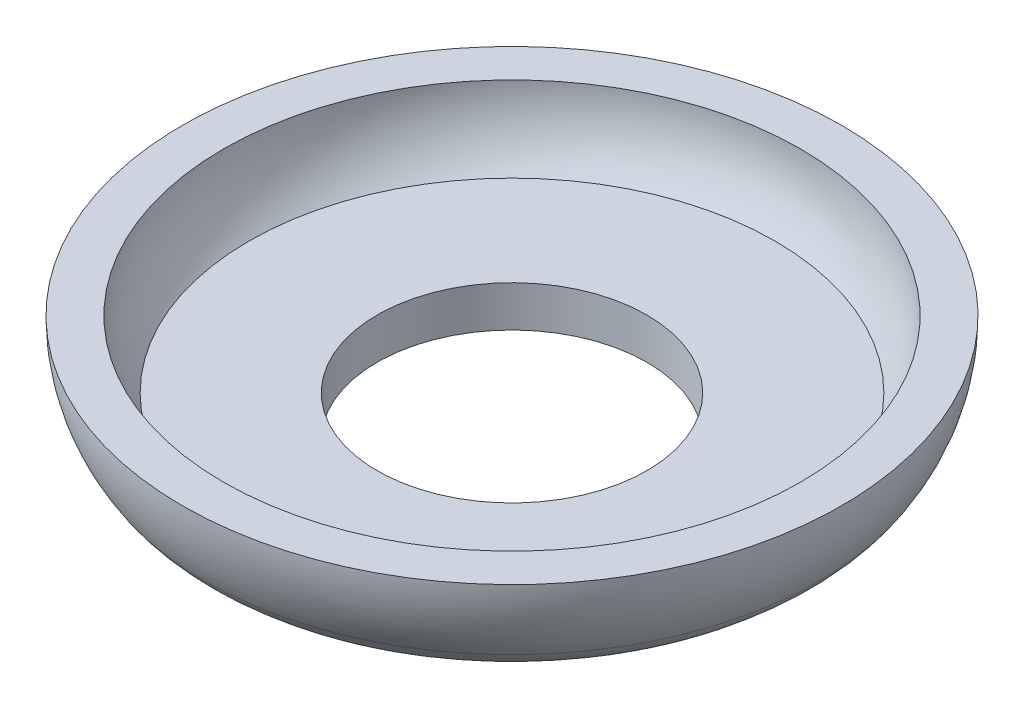
ISO-10303-21;
HEADER;
FILE_DESCRIPTION(('STEP AP214'),'2;1');
FILE_NAME('part.step','',(''),(''),'','','');
FILE_SCHEMA(('AUTOMOTIVE_DESIGN { 1 0 10303 214 1 1 1 1 }'));
ENDSEC;
DATA;
#1=APPLICATION_CONTEXT('core data for automotive mechanical design processes');
#2=APPLICATION_PROTOCOL_DEFINITION('international standard','automotive_design',2000,#1);
#3=PRODUCT_CONTEXT('',#1,'mechanical');
#4=PRODUCT('Part','Part','',(#3));
#5=PRODUCT_RELATED_PRODUCT_CATEGORY('part','',(#4));
#6=PRODUCT_DEFINITION_FORMATION('','',#4);
#7=PRODUCT_DEFINITION_CONTEXT('part definition',#1,'design');
#8=PRODUCT_DEFINITION('design','',#6,#7);
#9=PRODUCT_DEFINITION_SHAPE('','',#8);
#10=(LENGTH_UNIT() NAMED_UNIT(*) SI_UNIT(.MILLI.,.METRE.));
#11=(NAMED_UNIT(*) PLANE_ANGLE_UNIT() SI_UNIT($,.RADIAN.));
#12=(NAMED_UNIT(*) SI_UNIT($,.STERADIAN.) SOLID_ANGLE_UNIT());
#13=UNCERTAINTY_MEASURE_WITH_UNIT(LENGTH_MEASURE(1.E-05),#10,'distance_accuracy_value','');
#14=(GEOMETRIC_REPRESENTATION_CONTEXT(3) GLOBAL_UNCERTAINTY_ASSIGNED_CONTEXT((#13)) GLOBAL_UNIT_ASSIGNED_CONTEXT((#10,
#11,#12)) REPRESENTATION_CONTEXT('',''));
#15=CARTESIAN_POINT('',(0.,0.,0.));
#16=DIRECTION('',(0.,0.,1.));
#17=DIRECTION('',(1.,0.,0.));
#18=AXIS2_PLACEMENT_3D('',#15,#16,#17);
#19=CARTESIAN_POINT('',(0.,0.,0.));
#20=DIRECTION('',(0.,-1.,0.));
#21=DIRECTION('',(0.,0.,-1.));
#22=AXIS2_PLACEMENT_3D('',#19,#20,#21);
#23=CYLINDRICAL_SURFACE('',#22,5.0165);
#24=CARTESIAN_POINT('',(0.,0.,0.));
#25=DIRECTION('',(0.,-1.,0.));
#26=DIRECTION('',(0.,0.,-1.));
#27=AXIS2_PLACEMENT_3D('',#24,#25,#26);
#28=CIRCLE('',#27,5.0165);
#29=CARTESIAN_POINT('',(0.,0.,-5.0165));
#30=VERTEX_POINT('',#29);
#31=EDGE_CURVE('E10',#30,#30,#28,.T.);
#32=ORIENTED_EDGE('',*,*,#31,.T.);
#33=EDGE_LOOP('',(#32));
#34=FACE_BOUND('',#33,.T.);
#35=CARTESIAN_POINT('',(0.,1.524,0.));
#36=DIRECTION('',(0.,-1.,0.));
#37=DIRECTION('',(0.,0.,-1.));
#38=AXIS2_PLACEMENT_3D('',#35,#36,#37);
#39=CIRCLE('',#38,5.0165);
#40=CARTESIAN_POINT('',(0.,1.524,-5.0165));
#41=VERTEX_POINT('',#40);
#42=EDGE_CURVE('E55',#41,#41,#39,.T.);
#43=ORIENTED_EDGE('',*,*,#42,.F.);
#44=EDGE_LOOP('',(#43));
#45=FACE_BOUND('',#44,.T.);
#46=ADVANCED_FACE('F30',(#34,#45),#23,.F.);
#47=CARTESIAN_POINT('',(5.0165,0.,0.));
#48=DIRECTION('',(0.,-1.,0.));
#49=DIRECTION('',(0.,0.,-1.));
#50=AXIS2_PLACEMENT_3D('',#47,#48,#49);
#51=PLANE('',#50);
#52=CARTESIAN_POINT('',(0.,0.,0.));
#53=DIRECTION('',(0.,-1.,0.));
#54=DIRECTION('',(0.,0.,-1.));
#55=AXIS2_PLACEMENT_3D('',#52,#53,#54);
#56=CIRCLE('',#55,9.28063100395453);
#57=CARTESIAN_POINT('',(0.,0.,-9.28063100395453));
#58=VERTEX_POINT('',#57);
#59=EDGE_CURVE('E36',#58,#58,#56,.T.);
#60=ORIENTED_EDGE('',*,*,#59,.T.);
#61=EDGE_LOOP('',(#60));
#62=FACE_BOUND('',#61,.T.);
#63=ORIENTED_EDGE('',*,*,#31,.F.);
#64=EDGE_LOOP('',(#63));
#65=FACE_BOUND('',#64,.T.);
#66=ADVANCED_FACE('F63',(#62,#65),#51,.T.);
#67=CARTESIAN_POINT('',(0.,2.54,0.));
#68=DIRECTION('',(0.,-1.,0.));
#69=DIRECTION('',(0.,0.,-1.));
#70=AXIS2_PLACEMENT_3D('',#67,#68,#69);
#71=TOROIDAL_SURFACE('',#70,9.28063100395453,2.54);
#72=CARTESIAN_POINT('',(0.,1.16064230205049,0.));
#73=DIRECTION('',(0.,-1.,0.));
#74=DIRECTION('',(0.,0.,-1.));
#75=AXIS2_PLACEMENT_3D('',#72,#73,#74);
#76=CIRCLE('',#75,11.4134630041616);
#77=CARTESIAN_POINT('',(0.,1.16064230205049,-11.4134630041616));
#78=VERTEX_POINT('',#77);
#79=EDGE_CURVE('E40',#78,#78,#76,.T.);
#80=ORIENTED_EDGE('',*,*,#79,.T.);
#81=EDGE_LOOP('',(#80));
#82=FACE_BOUND('',#81,.T.);
#83=ORIENTED_EDGE('',*,*,#59,.F.);
#84=EDGE_LOOP('',(#83));
#85=FACE_BOUND('',#84,.T.);
#86=ADVANCED_FACE('F67',(#82,#85),#71,.T.);
#87=CARTESIAN_POINT('',(0.,4.0132,0.));
#88=DIRECTION('',(0.,-1.,0.));
#89=DIRECTION('',(0.,0.,-1.));
#90=AXIS2_PLACEMENT_3D('',#87,#88,#89);
#91=TOROIDAL_SURFACE('',#90,7.00269533333334,5.25280466666666);
#92=CARTESIAN_POINT('',(0.,4.0132,0.));
#93=DIRECTION('',(0.,-1.,0.));
#94=DIRECTION('',(0.,0.,-1.));
#95=AXIS2_PLACEMENT_3D('',#92,#93,#94);
#96=CIRCLE('',#95,12.2555);
#97=CARTESIAN_POINT('',(0.,4.0132,-12.2555));
#98=VERTEX_POINT('',#97);
#99=EDGE_CURVE('E44',#98,#98,#96,.T.);
#100=ORIENTED_EDGE('',*,*,#99,.T.);
#101=EDGE_LOOP('',(#100));
#102=FACE_BOUND('',#101,.T.);
#103=ORIENTED_EDGE('',*,*,#79,.F.);
#104=EDGE_LOOP('',(#103));
#105=FACE_BOUND('',#104,.T.);
#106=ADVANCED_FACE('F71',(#102,#105),#91,.T.);
#107=CARTESIAN_POINT('',(10.7315,4.0132,0.));
#108=DIRECTION('',(0.,1.,0.));
#109=DIRECTION('',(0.,0.,1.));
#110=AXIS2_PLACEMENT_3D('',#107,#108,#109);
#111=PLANE('',#110);
#112=CARTESIAN_POINT('',(0.,4.0132,0.));
#113=DIRECTION('',(0.,-1.,0.));
#114=DIRECTION('',(0.,0.,-1.));
#115=AXIS2_PLACEMENT_3D('',#112,#113,#114);
#116=CIRCLE('',#115,10.7315);
#117=CARTESIAN_POINT('',(0.,4.0132,-10.7315));
#118=VERTEX_POINT('',#117);
#119=EDGE_CURVE('E49',#118,#118,#116,.T.);
#120=ORIENTED_EDGE('',*,*,#119,.T.);
#121=EDGE_LOOP('',(#120));
#122=FACE_BOUND('',#121,.T.);
#123=ORIENTED_EDGE('',*,*,#99,.F.);
#124=EDGE_LOOP('',(#123));
#125=FACE_BOUND('',#124,.T.);
#126=ADVANCED_FACE('F78',(#122,#125),#111,.T.);
#127=CARTESIAN_POINT('',(0.,4.0132,0.));
#128=DIRECTION('',(0.,-1.,0.));
#129=DIRECTION('',(0.,0.,-1.));
#130=AXIS2_PLACEMENT_3D('',#127,#128,#129);
#131=TOROIDAL_SURFACE('',#130,7.00269533333334,3.72880466666666);
#132=CARTESIAN_POINT('',(0.,1.524,0.));
#133=DIRECTION('',(0.,-1.,0.));
#134=DIRECTION('',(0.,0.,-1.));
#135=AXIS2_PLACEMENT_3D('',#132,#133,#134);
#136=CIRCLE('',#135,9.779);
#137=CARTESIAN_POINT('',(0.,1.524,-9.779));
#138=VERTEX_POINT('',#137);
#139=EDGE_CURVE('E52',#138,#138,#136,.T.);
#140=ORIENTED_EDGE('',*,*,#139,.T.);
#141=EDGE_LOOP('',(#140));
#142=FACE_BOUND('',#141,.T.);
#143=ORIENTED_EDGE('',*,*,#119,.F.);
#144=EDGE_LOOP('',(#143));
#145=FACE_BOUND('',#144,.T.);
#146=ADVANCED_FACE('F82',(#142,#145),#131,.F.);
#147=CARTESIAN_POINT('',(5.0165,1.524,0.));
#148=DIRECTION('',(0.,1.,0.));
#149=DIRECTION('',(0.,0.,1.));
#150=AXIS2_PLACEMENT_3D('',#147,#148,#149);
#151=PLANE('',#150);
#152=ORIENTED_EDGE('',*,*,#42,.T.);
#153=EDGE_LOOP('',(#152));
#154=FACE_BOUND('',#153,.T.);
#155=ORIENTED_EDGE('',*,*,#139,.F.);
#156=EDGE_LOOP('',(#155));
#157=FACE_BOUND('',#156,.T.);
#158=ADVANCED_FACE('F59',(#154,#157),#151,.T.);
#159=CLOSED_SHELL('',(#46,#66,#86,#106,#126,#146,#158));
#160=MANIFOLD_SOLID_BREP('B2',#159);
#161=ADVANCED_BREP_SHAPE_REPRESENTATION('',(#18,#160),#14);
#162=SHAPE_DEFINITION_REPRESENTATION(#9,#161);
ENDSEC;
END-ISO-10303-21;
